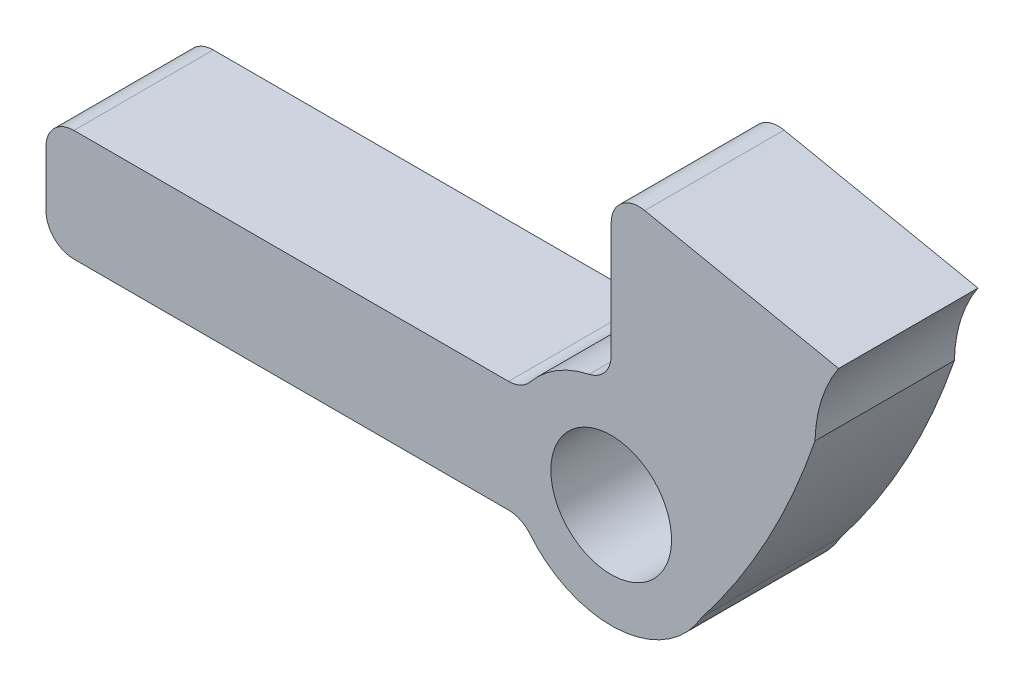
ISO-10303-21;
HEADER;
FILE_DESCRIPTION(('STEP AP214'),'2;1');
FILE_NAME('part.step','',(''),(''),'','','');
FILE_SCHEMA(('AUTOMOTIVE_DESIGN { 1 0 10303 214 1 1 1 1 }'));
ENDSEC;
DATA;
#1=APPLICATION_CONTEXT('core data for automotive mechanical design processes');
#2=APPLICATION_PROTOCOL_DEFINITION('international standard','automotive_design',2000,#1);
#3=PRODUCT_CONTEXT('',#1,'mechanical');
#4=PRODUCT('Part','Part','',(#3));
#5=PRODUCT_RELATED_PRODUCT_CATEGORY('part','',(#4));
#6=PRODUCT_DEFINITION_FORMATION('','',#4);
#7=PRODUCT_DEFINITION_CONTEXT('part definition',#1,'design');
#8=PRODUCT_DEFINITION('design','',#6,#7);
#9=PRODUCT_DEFINITION_SHAPE('','',#8);
#10=(LENGTH_UNIT() NAMED_UNIT(*) SI_UNIT(.MILLI.,.METRE.));
#11=(NAMED_UNIT(*) PLANE_ANGLE_UNIT() SI_UNIT($,.RADIAN.));
#12=(NAMED_UNIT(*) SI_UNIT($,.STERADIAN.) SOLID_ANGLE_UNIT());
#13=UNCERTAINTY_MEASURE_WITH_UNIT(LENGTH_MEASURE(1.E-05),#10,'distance_accuracy_value','');
#14=(GEOMETRIC_REPRESENTATION_CONTEXT(3) GLOBAL_UNCERTAINTY_ASSIGNED_CONTEXT((#13)) GLOBAL_UNIT_ASSIGNED_CONTEXT((#10,
#11,#12)) REPRESENTATION_CONTEXT('',''));
#15=CARTESIAN_POINT('',(0.,0.,0.));
#16=DIRECTION('',(0.,0.,1.));
#17=DIRECTION('',(1.,0.,0.));
#18=AXIS2_PLACEMENT_3D('',#15,#16,#17);
#19=CARTESIAN_POINT('',(0.,0.,0.));
#20=DIRECTION('',(0.,0.,-1.));
#21=DIRECTION('',(-1.,0.,0.));
#22=AXIS2_PLACEMENT_3D('',#19,#20,#21);
#23=PLANE('',#22);
#24=CARTESIAN_POINT('',(31.5279016396523,26.917706060105,0.));
#25=DIRECTION('',(0.,0.,-1.));
#26=DIRECTION('',(-1.,0.,0.));
#27=AXIS2_PLACEMENT_3D('',#24,#25,#26);
#28=CIRCLE('',#27,2.75);
#29=CARTESIAN_POINT('',(28.7779016396523,26.917706060105,0.));
#30=VERTEX_POINT('',#29);
#31=EDGE_CURVE('E43',#30,#30,#28,.T.);
#32=ORIENTED_EDGE('',*,*,#31,.F.);
#33=EDGE_LOOP('',(#32));
#34=FACE_BOUND('',#33,.T.);
#35=CARTESIAN_POINT('',(47.1645659339847,33.9451594546823,0.));
#36=DIRECTION('',(0.,0.,1.));
#37=DIRECTION('',(-1.,0.,0.));
#38=AXIS2_PLACEMENT_3D('',#35,#36,#37);
#39=CIRCLE('',#38,6.35000000000001);
#40=CARTESIAN_POINT('',(41.893380204959,37.4859363482631,0.));
#41=VERTEX_POINT('',#40);
#42=CARTESIAN_POINT('',(40.8161922352779,34.0888653403209,0.));
#43=VERTEX_POINT('',#42);
#44=EDGE_CURVE('E170',#41,#43,#39,.T.);
#45=ORIENTED_EDGE('',*,*,#44,.T.);
#46=CARTESIAN_POINT('',(9.96866323767214,44.5924918390402,0.));
#47=DIRECTION('',(0.,0.,-1.));
#48=DIRECTION('',(-1.,0.,0.));
#49=AXIS2_PLACEMENT_3D('',#46,#47,#48);
#50=CIRCLE('',#49,32.5867490689502);
#51=CARTESIAN_POINT('',(35.6523476251745,24.5364560601058,0.));
#52=VERTEX_POINT('',#51);
#53=EDGE_CURVE('E216',#43,#52,#50,.T.);
#54=ORIENTED_EDGE('',*,*,#53,.T.);
#55=CARTESIAN_POINT('',(31.5279016396523,26.917706060105,0.));
#56=DIRECTION('',(0.,0.,-1.));
#57=DIRECTION('',(-1.,0.,0.));
#58=AXIS2_PLACEMENT_3D('',#55,#56,#57);
#59=CIRCLE('',#58,4.76249999999865);
#60=CARTESIAN_POINT('',(27.8354802793434,23.909811323263,0.));
#61=VERTEX_POINT('',#60);
#62=EDGE_CURVE('E214',#52,#61,#59,.T.);
#63=ORIENTED_EDGE('',*,*,#62,.T.);
#64=CARTESIAN_POINT('',(26.8508345832607,23.1077060601049,0.));
#65=DIRECTION('',(0.,0.,1.));
#66=DIRECTION('',(-1.,0.,0.));
#67=AXIS2_PLACEMENT_3D('',#64,#65,#66);
#68=CIRCLE('',#67,1.27);
#69=CARTESIAN_POINT('',(26.8508345832607,24.3777060601049,0.));
#70=VERTEX_POINT('',#69);
#71=EDGE_CURVE('E62',#61,#70,#68,.T.);
#72=ORIENTED_EDGE('',*,*,#71,.T.);
#73=DIRECTION('',(-1.,0.,0.));
#74=VECTOR('',#73,1.);
#75=CARTESIAN_POINT('',(26.8508345832607,24.3777060601049,0.));
#76=LINE('',#75,#74);
#77=CARTESIAN_POINT('',(7.04230163965219,24.3777060601049,0.));
#78=VERTEX_POINT('',#77);
#79=EDGE_CURVE('E210',#70,#78,#76,.T.);
#80=ORIENTED_EDGE('',*,*,#79,.T.);
#81=CARTESIAN_POINT('',(7.04230163965224,25.6477060601049,0.));
#82=DIRECTION('',(0.,0.,-1.));
#83=DIRECTION('',(-1.,0.,0.));
#84=AXIS2_PLACEMENT_3D('',#81,#82,#83);
#85=CIRCLE('',#84,1.27000000000003);
#86=CARTESIAN_POINT('',(5.77230163965221,25.6477060601049,0.));
#87=VERTEX_POINT('',#86);
#88=EDGE_CURVE('E207',#78,#87,#85,.T.);
#89=ORIENTED_EDGE('',*,*,#88,.T.);
#90=DIRECTION('',(0.,1.,0.));
#91=VECTOR('',#90,1.);
#92=CARTESIAN_POINT('',(5.77230163965224,28.1877060601049,0.));
#93=LINE('',#92,#91);
#94=CARTESIAN_POINT('',(5.77230163965224,28.1877060601049,0.));
#95=VERTEX_POINT('',#94);
#96=EDGE_CURVE('E204',#87,#95,#93,.T.);
#97=ORIENTED_EDGE('',*,*,#96,.T.);
#98=CARTESIAN_POINT('',(7.04230163965223,28.1877060601049,0.));
#99=DIRECTION('',(0.,0.,-1.));
#100=DIRECTION('',(-1.,0.,0.));
#101=AXIS2_PLACEMENT_3D('',#98,#99,#100);
#102=CIRCLE('',#101,1.27);
#103=CARTESIAN_POINT('',(7.04230163965223,29.4577060601049,0.));
#104=VERTEX_POINT('',#103);
#105=EDGE_CURVE('E201',#95,#104,#102,.T.);
#106=ORIENTED_EDGE('',*,*,#105,.T.);
#107=DIRECTION('',(1.,0.,0.));
#108=VECTOR('',#107,1.);
#109=CARTESIAN_POINT('',(26.8508345832607,29.4577060601049,0.));
#110=LINE('',#109,#108);
#111=CARTESIAN_POINT('',(26.8508345832607,29.4577060601049,0.));
#112=VERTEX_POINT('',#111);
#113=EDGE_CURVE('E198',#104,#112,#110,.T.);
#114=ORIENTED_EDGE('',*,*,#113,.T.);
#115=CARTESIAN_POINT('',(26.8508345832607,30.7277060601049,0.));
#116=DIRECTION('',(0.,0.,1.));
#117=DIRECTION('',(-1.,0.,0.));
#118=AXIS2_PLACEMENT_3D('',#115,#116,#117);
#119=CIRCLE('',#118,1.27);
#120=CARTESIAN_POINT('',(27.8354802793434,29.9256007969468,0.));
#121=VERTEX_POINT('',#120);
#122=EDGE_CURVE('E195',#112,#121,#119,.T.);
#123=ORIENTED_EDGE('',*,*,#122,.T.);
#124=CARTESIAN_POINT('',(31.5279016396523,26.917706060105,0.));
#125=DIRECTION('',(0.,0.,-1.));
#126=DIRECTION('',(-1.,0.,0.));
#127=AXIS2_PLACEMENT_3D('',#124,#125,#126);
#128=CIRCLE('',#127,4.76249999999849);
#129=CARTESIAN_POINT('',(30.5252700607049,31.5734698177374,0.));
#130=VERTEX_POINT('',#129);
#131=EDGE_CURVE('E192',#121,#130,#128,.T.);
#132=ORIENTED_EDGE('',*,*,#131,.T.);
#133=CARTESIAN_POINT('',(30.2579016396522,32.8150068197731,0.));
#134=DIRECTION('',(0.,0.,1.));
#135=DIRECTION('',(-1.,0.,0.));
#136=AXIS2_PLACEMENT_3D('',#133,#134,#135);
#137=CIRCLE('',#136,1.27000000000001);
#138=CARTESIAN_POINT('',(31.5279016396522,32.8150068197731,0.));
#139=VERTEX_POINT('',#138);
#140=EDGE_CURVE('E189',#130,#139,#137,.T.);
#141=ORIENTED_EDGE('',*,*,#140,.T.);
#142=DIRECTION('',(0.,1.,0.));
#143=VECTOR('',#142,1.);
#144=CARTESIAN_POINT('',(31.5279016396522,38.0574046258228,0.));
#145=LINE('',#144,#143);
#146=CARTESIAN_POINT('',(31.5279016396522,38.0574046258228,0.));
#147=VERTEX_POINT('',#146);
#148=EDGE_CURVE('E186',#139,#147,#145,.T.);
#149=ORIENTED_EDGE('',*,*,#148,.T.);
#150=CARTESIAN_POINT('',(32.7979016396522,38.0574046258228,0.));
#151=DIRECTION('',(0.,0.,-1.));
#152=DIRECTION('',(-1.,0.,0.));
#153=AXIS2_PLACEMENT_3D('',#150,#151,#152);
#154=CIRCLE('',#153,1.27);
#155=CARTESIAN_POINT('',(33.0557148185302,39.3009609634275,0.));
#156=VERTEX_POINT('',#155);
#157=EDGE_CURVE('E178',#147,#156,#154,.T.);
#158=ORIENTED_EDGE('',*,*,#157,.T.);
#159=DIRECTION('',(0.979555324329309,-0.201174965087861,0.));
#160=VECTOR('',#159,1.);
#161=CARTESIAN_POINT('',(41.893380204959,37.4859363482631,0.));
#162=LINE('',#161,#160);
#163=EDGE_CURVE('E172',#156,#41,#162,.T.);
#164=ORIENTED_EDGE('',*,*,#163,.T.);
#165=EDGE_LOOP('',(#45,#54,#63,#72,#80,#89,#97,#106,#114,#123,#132,#141,#149,#158,#164));
#166=FACE_BOUND('',#165,.T.);
#167=ADVANCED_FACE('F40',(#34,#166),#23,.T.);
#168=CARTESIAN_POINT('',(31.5279016396523,26.917706060105,6.35));
#169=DIRECTION('',(0.,0.,-1.));
#170=DIRECTION('',(-1.,0.,0.));
#171=AXIS2_PLACEMENT_3D('',#168,#169,#170);
#172=CYLINDRICAL_SURFACE('',#171,2.75);
#173=CARTESIAN_POINT('',(31.5279016396523,26.917706060105,6.35));
#174=DIRECTION('',(0.,0.,-1.));
#175=DIRECTION('',(-1.,0.,0.));
#176=AXIS2_PLACEMENT_3D('',#173,#174,#175);
#177=CIRCLE('',#176,2.75);
#178=CARTESIAN_POINT('',(28.7779016396523,26.917706060105,6.35));
#179=VERTEX_POINT('',#178);
#180=EDGE_CURVE('E12',#179,#179,#177,.T.);
#181=ORIENTED_EDGE('',*,*,#180,.F.);
#182=EDGE_LOOP('',(#181));
#183=FACE_BOUND('',#182,.T.);
#184=ORIENTED_EDGE('',*,*,#31,.T.);
#185=EDGE_LOOP('',(#184));
#186=FACE_BOUND('',#185,.T.);
#187=ADVANCED_FACE('F300',(#183,#186),#172,.F.);
#188=CARTESIAN_POINT('',(9.96866323767214,44.5924918390402,6.35));
#189=DIRECTION('',(0.,0.,-1.));
#190=DIRECTION('',(-1.,0.,0.));
#191=AXIS2_PLACEMENT_3D('',#188,#189,#190);
#192=CYLINDRICAL_SURFACE('',#191,32.5867490689502);
#193=ORIENTED_EDGE('',*,*,#53,.F.);
#194=DIRECTION('',(0.,0.,-1.));
#195=VECTOR('',#194,1.);
#196=CARTESIAN_POINT('',(40.8161922352779,34.0888653403209,6.35));
#197=LINE('',#196,#195);
#198=CARTESIAN_POINT('',(40.8161922352779,34.0888653403209,6.35));
#199=VERTEX_POINT('',#198);
#200=EDGE_CURVE('E181',#199,#43,#197,.T.);
#201=ORIENTED_EDGE('',*,*,#200,.F.);
#202=CARTESIAN_POINT('',(9.96866323767214,44.5924918390402,6.35));
#203=DIRECTION('',(0.,0.,-1.));
#204=DIRECTION('',(-1.,0.,0.));
#205=AXIS2_PLACEMENT_3D('',#202,#203,#204);
#206=CIRCLE('',#205,32.5867490689502);
#207=CARTESIAN_POINT('',(35.6523476251745,24.5364560601058,6.35));
#208=VERTEX_POINT('',#207);
#209=EDGE_CURVE('E54',#199,#208,#206,.T.);
#210=ORIENTED_EDGE('',*,*,#209,.T.);
#211=DIRECTION('',(0.,0.,-1.));
#212=VECTOR('',#211,1.);
#213=CARTESIAN_POINT('',(35.6523476251745,24.5364560601058,6.35));
#214=LINE('',#213,#212);
#215=EDGE_CURVE('E153',#208,#52,#214,.T.);
#216=ORIENTED_EDGE('',*,*,#215,.T.);
#217=EDGE_LOOP('',(#193,#201,#210,#216));
#218=FACE_BOUND('',#217,.T.);
#219=ADVANCED_FACE('F286',(#218),#192,.T.);
#220=CARTESIAN_POINT('',(47.1645659339847,33.9451594546823,6.35));
#221=DIRECTION('',(0.,0.,-1.));
#222=DIRECTION('',(-1.,0.,0.));
#223=AXIS2_PLACEMENT_3D('',#220,#221,#222);
#224=CYLINDRICAL_SURFACE('',#223,6.35000000000001);
#225=ORIENTED_EDGE('',*,*,#44,.F.);
#226=DIRECTION('',(0.,0.,-1.));
#227=VECTOR('',#226,1.);
#228=CARTESIAN_POINT('',(41.893380204959,37.4859363482631,6.35));
#229=LINE('',#228,#227);
#230=CARTESIAN_POINT('',(41.893380204959,37.4859363482631,6.35));
#231=VERTEX_POINT('',#230);
#232=EDGE_CURVE('E279',#231,#41,#229,.T.);
#233=ORIENTED_EDGE('',*,*,#232,.F.);
#234=CARTESIAN_POINT('',(47.1645659339847,33.9451594546823,6.35));
#235=DIRECTION('',(0.,0.,1.));
#236=DIRECTION('',(-1.,0.,0.));
#237=AXIS2_PLACEMENT_3D('',#234,#235,#236);
#238=CIRCLE('',#237,6.35000000000001);
#239=EDGE_CURVE('E218',#231,#199,#238,.T.);
#240=ORIENTED_EDGE('',*,*,#239,.T.);
#241=ORIENTED_EDGE('',*,*,#200,.T.);
#242=EDGE_LOOP('',(#225,#233,#240,#241));
#243=FACE_BOUND('',#242,.T.);
#244=ADVANCED_FACE('F284',(#243),#224,.F.);
#245=CARTESIAN_POINT('',(41.893380204959,37.4859363482631,6.35));
#246=DIRECTION('',(0.201174965087861,0.979555324329309,0.));
#247=DIRECTION('',(-0.979555324329309,0.201174965087861,0.));
#248=AXIS2_PLACEMENT_3D('',#245,#246,#247);
#249=PLANE('',#248);
#250=ORIENTED_EDGE('',*,*,#163,.F.);
#251=DIRECTION('',(0.,0.,-1.));
#252=VECTOR('',#251,1.);
#253=CARTESIAN_POINT('',(33.0557148185302,39.3009609634275,6.35));
#254=LINE('',#253,#252);
#255=CARTESIAN_POINT('',(33.0557148185302,39.3009609634275,6.35));
#256=VERTEX_POINT('',#255);
#257=EDGE_CURVE('E278',#256,#156,#254,.T.);
#258=ORIENTED_EDGE('',*,*,#257,.F.);
#259=DIRECTION('',(0.979555324329309,-0.201174965087861,0.));
#260=VECTOR('',#259,1.);
#261=CARTESIAN_POINT('',(41.893380204959,37.4859363482631,6.35));
#262=LINE('',#261,#260);
#263=EDGE_CURVE('E221',#256,#231,#262,.T.);
#264=ORIENTED_EDGE('',*,*,#263,.T.);
#265=ORIENTED_EDGE('',*,*,#232,.T.);
#266=EDGE_LOOP('',(#250,#258,#264,#265));
#267=FACE_BOUND('',#266,.T.);
#268=ADVANCED_FACE('F419',(#267),#249,.T.);
#269=CARTESIAN_POINT('',(32.7979016396522,38.0574046258228,6.35));
#270=DIRECTION('',(0.,0.,-1.));
#271=DIRECTION('',(-1.,0.,0.));
#272=AXIS2_PLACEMENT_3D('',#269,#270,#271);
#273=CYLINDRICAL_SURFACE('',#272,1.27);
#274=ORIENTED_EDGE('',*,*,#157,.F.);
#275=DIRECTION('',(0.,0.,-1.));
#276=VECTOR('',#275,1.);
#277=CARTESIAN_POINT('',(31.5279016396522,38.0574046258228,6.35));
#278=LINE('',#277,#276);
#279=CARTESIAN_POINT('',(31.5279016396522,38.0574046258228,6.35));
#280=VERTEX_POINT('',#279);
#281=EDGE_CURVE('E276',#280,#147,#278,.T.);
#282=ORIENTED_EDGE('',*,*,#281,.F.);
#283=CARTESIAN_POINT('',(32.7979016396522,38.0574046258228,6.35));
#284=DIRECTION('',(0.,0.,-1.));
#285=DIRECTION('',(-1.,0.,0.));
#286=AXIS2_PLACEMENT_3D('',#283,#284,#285);
#287=CIRCLE('',#286,1.27);
#288=EDGE_CURVE('E224',#280,#256,#287,.T.);
#289=ORIENTED_EDGE('',*,*,#288,.T.);
#290=ORIENTED_EDGE('',*,*,#257,.T.);
#291=EDGE_LOOP('',(#274,#282,#289,#290));
#292=FACE_BOUND('',#291,.T.);
#293=ADVANCED_FACE('F409',(#292),#273,.T.);
#294=CARTESIAN_POINT('',(31.5279016396522,38.0574046258228,6.35));
#295=DIRECTION('',(-1.,0.,0.));
#296=DIRECTION('',(0.,-1.,0.));
#297=AXIS2_PLACEMENT_3D('',#294,#295,#296);
#298=PLANE('',#297);
#299=ORIENTED_EDGE('',*,*,#148,.F.);
#300=DIRECTION('',(0.,0.,-1.));
#301=VECTOR('',#300,1.);
#302=CARTESIAN_POINT('',(31.5279016396522,32.8150068197731,6.35));
#303=LINE('',#302,#301);
#304=CARTESIAN_POINT('',(31.5279016396522,32.8150068197731,6.35));
#305=VERTEX_POINT('',#304);
#306=EDGE_CURVE('E274',#305,#139,#303,.T.);
#307=ORIENTED_EDGE('',*,*,#306,.F.);
#308=DIRECTION('',(0.,1.,0.));
#309=VECTOR('',#308,1.);
#310=CARTESIAN_POINT('',(31.5279016396522,38.0574046258228,6.35));
#311=LINE('',#310,#309);
#312=EDGE_CURVE('E227',#305,#280,#311,.T.);
#313=ORIENTED_EDGE('',*,*,#312,.T.);
#314=ORIENTED_EDGE('',*,*,#281,.T.);
#315=EDGE_LOOP('',(#299,#307,#313,#314));
#316=FACE_BOUND('',#315,.T.);
#317=ADVANCED_FACE('F399',(#316),#298,.T.);
#318=CARTESIAN_POINT('',(30.2579016396522,32.8150068197731,6.35));
#319=DIRECTION('',(0.,0.,-1.));
#320=DIRECTION('',(-1.,0.,0.));
#321=AXIS2_PLACEMENT_3D('',#318,#319,#320);
#322=CYLINDRICAL_SURFACE('',#321,1.27000000000001);
#323=ORIENTED_EDGE('',*,*,#140,.F.);
#324=DIRECTION('',(0.,0.,-1.));
#325=VECTOR('',#324,1.);
#326=CARTESIAN_POINT('',(30.5252700607049,31.5734698177374,6.35));
#327=LINE('',#326,#325);
#328=CARTESIAN_POINT('',(30.5252700607049,31.5734698177374,6.35));
#329=VERTEX_POINT('',#328);
#330=EDGE_CURVE('E272',#329,#130,#327,.T.);
#331=ORIENTED_EDGE('',*,*,#330,.F.);
#332=CARTESIAN_POINT('',(30.2579016396522,32.8150068197731,6.35));
#333=DIRECTION('',(0.,0.,1.));
#334=DIRECTION('',(-1.,0.,0.));
#335=AXIS2_PLACEMENT_3D('',#332,#333,#334);
#336=CIRCLE('',#335,1.27000000000001);
#337=EDGE_CURVE('E230',#329,#305,#336,.T.);
#338=ORIENTED_EDGE('',*,*,#337,.T.);
#339=ORIENTED_EDGE('',*,*,#306,.T.);
#340=EDGE_LOOP('',(#323,#331,#338,#339));
#341=FACE_BOUND('',#340,.T.);
#342=ADVANCED_FACE('F389',(#341),#322,.F.);
#343=CARTESIAN_POINT('',(31.5279016396523,26.917706060105,6.35));
#344=DIRECTION('',(0.,0.,-1.));
#345=DIRECTION('',(-1.,0.,0.));
#346=AXIS2_PLACEMENT_3D('',#343,#344,#345);
#347=CYLINDRICAL_SURFACE('',#346,4.76249999999849);
#348=ORIENTED_EDGE('',*,*,#131,.F.);
#349=DIRECTION('',(0.,0.,-1.));
#350=VECTOR('',#349,1.);
#351=CARTESIAN_POINT('',(27.8354802793434,29.9256007969468,6.35));
#352=LINE('',#351,#350);
#353=CARTESIAN_POINT('',(27.8354802793434,29.9256007969468,6.35));
#354=VERTEX_POINT('',#353);
#355=EDGE_CURVE('E270',#354,#121,#352,.T.);
#356=ORIENTED_EDGE('',*,*,#355,.F.);
#357=CARTESIAN_POINT('',(31.5279016396523,26.917706060105,6.35));
#358=DIRECTION('',(0.,0.,-1.));
#359=DIRECTION('',(-1.,0.,0.));
#360=AXIS2_PLACEMENT_3D('',#357,#358,#359);
#361=CIRCLE('',#360,4.76249999999849);
#362=EDGE_CURVE('E233',#354,#329,#361,.T.);
#363=ORIENTED_EDGE('',*,*,#362,.T.);
#364=ORIENTED_EDGE('',*,*,#330,.T.);
#365=EDGE_LOOP('',(#348,#356,#363,#364));
#366=FACE_BOUND('',#365,.T.);
#367=ADVANCED_FACE('F379',(#366),#347,.T.);
#368=CARTESIAN_POINT('',(26.8508345832607,30.7277060601049,6.35));
#369=DIRECTION('',(0.,0.,-1.));
#370=DIRECTION('',(-1.,0.,0.));
#371=AXIS2_PLACEMENT_3D('',#368,#369,#370);
#372=CYLINDRICAL_SURFACE('',#371,1.27);
#373=ORIENTED_EDGE('',*,*,#122,.F.);
#374=DIRECTION('',(0.,0.,-1.));
#375=VECTOR('',#374,1.);
#376=CARTESIAN_POINT('',(26.8508345832607,29.4577060601049,6.35));
#377=LINE('',#376,#375);
#378=CARTESIAN_POINT('',(26.8508345832607,29.4577060601049,6.35));
#379=VERTEX_POINT('',#378);
#380=EDGE_CURVE('E268',#379,#112,#377,.T.);
#381=ORIENTED_EDGE('',*,*,#380,.F.);
#382=CARTESIAN_POINT('',(26.8508345832607,30.7277060601049,6.35));
#383=DIRECTION('',(0.,0.,1.));
#384=DIRECTION('',(-1.,0.,0.));
#385=AXIS2_PLACEMENT_3D('',#382,#383,#384);
#386=CIRCLE('',#385,1.27);
#387=EDGE_CURVE('E236',#379,#354,#386,.T.);
#388=ORIENTED_EDGE('',*,*,#387,.T.);
#389=ORIENTED_EDGE('',*,*,#355,.T.);
#390=EDGE_LOOP('',(#373,#381,#388,#389));
#391=FACE_BOUND('',#390,.T.);
#392=ADVANCED_FACE('F369',(#391),#372,.F.);
#393=CARTESIAN_POINT('',(26.8508345832607,29.4577060601049,6.35));
#394=DIRECTION('',(0.,1.,0.));
#395=DIRECTION('',(-1.,0.,0.));
#396=AXIS2_PLACEMENT_3D('',#393,#394,#395);
#397=PLANE('',#396);
#398=ORIENTED_EDGE('',*,*,#113,.F.);
#399=DIRECTION('',(0.,0.,-1.));
#400=VECTOR('',#399,1.);
#401=CARTESIAN_POINT('',(7.04230163965223,29.4577060601049,6.35));
#402=LINE('',#401,#400);
#403=CARTESIAN_POINT('',(7.04230163965223,29.4577060601049,6.35));
#404=VERTEX_POINT('',#403);
#405=EDGE_CURVE('E263',#404,#104,#402,.T.);
#406=ORIENTED_EDGE('',*,*,#405,.F.);
#407=DIRECTION('',(1.,0.,0.));
#408=VECTOR('',#407,1.);
#409=CARTESIAN_POINT('',(26.8508345832607,29.4577060601049,6.35));
#410=LINE('',#409,#408);
#411=EDGE_CURVE('E239',#404,#379,#410,.T.);
#412=ORIENTED_EDGE('',*,*,#411,.T.);
#413=ORIENTED_EDGE('',*,*,#380,.T.);
#414=EDGE_LOOP('',(#398,#406,#412,#413));
#415=FACE_BOUND('',#414,.T.);
#416=ADVANCED_FACE('F359',(#415),#397,.T.);
#417=CARTESIAN_POINT('',(7.04230163965223,28.1877060601049,6.35));
#418=DIRECTION('',(0.,0.,-1.));
#419=DIRECTION('',(-1.,0.,0.));
#420=AXIS2_PLACEMENT_3D('',#417,#418,#419);
#421=CYLINDRICAL_SURFACE('',#420,1.27);
#422=ORIENTED_EDGE('',*,*,#105,.F.);
#423=DIRECTION('',(0.,0.,-1.));
#424=VECTOR('',#423,1.);
#425=CARTESIAN_POINT('',(5.77230163965224,28.1877060601049,6.35));
#426=LINE('',#425,#424);
#427=CARTESIAN_POINT('',(5.77230163965224,28.1877060601049,6.35));
#428=VERTEX_POINT('',#427);
#429=EDGE_CURVE('E259',#428,#95,#426,.T.);
#430=ORIENTED_EDGE('',*,*,#429,.F.);
#431=CARTESIAN_POINT('',(7.04230163965223,28.1877060601049,6.35));
#432=DIRECTION('',(0.,0.,-1.));
#433=DIRECTION('',(-1.,0.,0.));
#434=AXIS2_PLACEMENT_3D('',#431,#432,#433);
#435=CIRCLE('',#434,1.27);
#436=EDGE_CURVE('E242',#428,#404,#435,.T.);
#437=ORIENTED_EDGE('',*,*,#436,.T.);
#438=ORIENTED_EDGE('',*,*,#405,.T.);
#439=EDGE_LOOP('',(#422,#430,#437,#438));
#440=FACE_BOUND('',#439,.T.);
#441=ADVANCED_FACE('F350',(#440),#421,.T.);
#442=CARTESIAN_POINT('',(5.77230163965224,28.1877060601049,6.35));
#443=DIRECTION('',(-1.,0.,0.));
#444=DIRECTION('',(0.,-1.,0.));
#445=AXIS2_PLACEMENT_3D('',#442,#443,#444);
#446=PLANE('',#445);
#447=ORIENTED_EDGE('',*,*,#96,.F.);
#448=DIRECTION('',(0.,0.,-1.));
#449=VECTOR('',#448,1.);
#450=CARTESIAN_POINT('',(5.77230163965221,25.6477060601049,6.35));
#451=LINE('',#450,#449);
#452=CARTESIAN_POINT('',(5.77230163965221,25.6477060601049,6.35));
#453=VERTEX_POINT('',#452);
#454=EDGE_CURVE('E252',#453,#87,#451,.T.);
#455=ORIENTED_EDGE('',*,*,#454,.F.);
#456=DIRECTION('',(0.,1.,0.));
#457=VECTOR('',#456,1.);
#458=CARTESIAN_POINT('',(5.77230163965224,28.1877060601049,6.35));
#459=LINE('',#458,#457);
#460=EDGE_CURVE('E245',#453,#428,#459,.T.);
#461=ORIENTED_EDGE('',*,*,#460,.T.);
#462=ORIENTED_EDGE('',*,*,#429,.T.);
#463=EDGE_LOOP('',(#447,#455,#461,#462));
#464=FACE_BOUND('',#463,.T.);
#465=ADVANCED_FACE('F258',(#464),#446,.T.);
#466=CARTESIAN_POINT('',(7.04230163965224,25.6477060601049,6.35));
#467=DIRECTION('',(0.,0.,-1.));
#468=DIRECTION('',(-1.,0.,0.));
#469=AXIS2_PLACEMENT_3D('',#466,#467,#468);
#470=CYLINDRICAL_SURFACE('',#469,1.27000000000003);
#471=ORIENTED_EDGE('',*,*,#88,.F.);
#472=DIRECTION('',(0.,0.,-1.));
#473=VECTOR('',#472,1.);
#474=CARTESIAN_POINT('',(7.04230163965219,24.3777060601049,6.35));
#475=LINE('',#474,#473);
#476=CARTESIAN_POINT('',(7.04230163965219,24.3777060601049,6.35));
#477=VERTEX_POINT('',#476);
#478=EDGE_CURVE('E254',#477,#78,#475,.T.);
#479=ORIENTED_EDGE('',*,*,#478,.F.);
#480=CARTESIAN_POINT('',(7.04230163965224,25.6477060601049,6.35));
#481=DIRECTION('',(0.,0.,-1.));
#482=DIRECTION('',(-1.,0.,0.));
#483=AXIS2_PLACEMENT_3D('',#480,#481,#482);
#484=CIRCLE('',#483,1.27000000000003);
#485=EDGE_CURVE('E166',#477,#453,#484,.T.);
#486=ORIENTED_EDGE('',*,*,#485,.T.);
#487=ORIENTED_EDGE('',*,*,#454,.T.);
#488=EDGE_LOOP('',(#471,#479,#486,#487));
#489=FACE_BOUND('',#488,.T.);
#490=ADVANCED_FACE('F251',(#489),#470,.T.);
#491=CARTESIAN_POINT('',(26.8508345832607,24.3777060601049,6.35));
#492=DIRECTION('',(0.,-1.,0.));
#493=DIRECTION('',(1.,0.,0.));
#494=AXIS2_PLACEMENT_3D('',#491,#492,#493);
#495=PLANE('',#494);
#496=ORIENTED_EDGE('',*,*,#79,.F.);
#497=DIRECTION('',(0.,0.,-1.));
#498=VECTOR('',#497,1.);
#499=CARTESIAN_POINT('',(26.8508345832607,24.3777060601049,6.35));
#500=LINE('',#499,#498);
#501=CARTESIAN_POINT('',(26.8508345832607,24.3777060601049,6.35));
#502=VERTEX_POINT('',#501);
#503=EDGE_CURVE('E154',#502,#70,#500,.T.);
#504=ORIENTED_EDGE('',*,*,#503,.F.);
#505=DIRECTION('',(-1.,0.,0.));
#506=VECTOR('',#505,1.);
#507=CARTESIAN_POINT('',(26.8508345832607,24.3777060601049,6.35));
#508=LINE('',#507,#506);
#509=EDGE_CURVE('E164',#502,#477,#508,.T.);
#510=ORIENTED_EDGE('',*,*,#509,.T.);
#511=ORIENTED_EDGE('',*,*,#478,.T.);
#512=EDGE_LOOP('',(#496,#504,#510,#511));
#513=FACE_BOUND('',#512,.T.);
#514=ADVANCED_FACE('F289',(#513),#495,.T.);
#515=CARTESIAN_POINT('',(26.8508345832607,23.1077060601049,6.35));
#516=DIRECTION('',(0.,0.,-1.));
#517=DIRECTION('',(-1.,0.,0.));
#518=AXIS2_PLACEMENT_3D('',#515,#516,#517);
#519=CYLINDRICAL_SURFACE('',#518,1.27);
#520=ORIENTED_EDGE('',*,*,#71,.F.);
#521=DIRECTION('',(0.,0.,-1.));
#522=VECTOR('',#521,1.);
#523=CARTESIAN_POINT('',(27.8354802793434,23.909811323263,6.35));
#524=LINE('',#523,#522);
#525=CARTESIAN_POINT('',(27.8354802793434,23.909811323263,6.35));
#526=VERTEX_POINT('',#525);
#527=EDGE_CURVE('E144',#526,#61,#524,.T.);
#528=ORIENTED_EDGE('',*,*,#527,.F.);
#529=CARTESIAN_POINT('',(26.8508345832607,23.1077060601049,6.35));
#530=DIRECTION('',(0.,0.,1.));
#531=DIRECTION('',(-1.,0.,0.));
#532=AXIS2_PLACEMENT_3D('',#529,#530,#531);
#533=CIRCLE('',#532,1.27);
#534=EDGE_CURVE('E148',#526,#502,#533,.T.);
#535=ORIENTED_EDGE('',*,*,#534,.T.);
#536=ORIENTED_EDGE('',*,*,#503,.T.);
#537=EDGE_LOOP('',(#520,#528,#535,#536));
#538=FACE_BOUND('',#537,.T.);
#539=ADVANCED_FACE('F146',(#538),#519,.F.);
#540=CARTESIAN_POINT('',(31.5279016396523,26.917706060105,6.35));
#541=DIRECTION('',(0.,0.,-1.));
#542=DIRECTION('',(-1.,0.,0.));
#543=AXIS2_PLACEMENT_3D('',#540,#541,#542);
#544=CYLINDRICAL_SURFACE('',#543,4.76249999999865);
#545=ORIENTED_EDGE('',*,*,#62,.F.);
#546=ORIENTED_EDGE('',*,*,#215,.F.);
#547=CARTESIAN_POINT('',(31.5279016396523,26.917706060105,6.35));
#548=DIRECTION('',(0.,0.,-1.));
#549=DIRECTION('',(-1.,0.,0.));
#550=AXIS2_PLACEMENT_3D('',#547,#548,#549);
#551=CIRCLE('',#550,4.76249999999865);
#552=EDGE_CURVE('E157',#208,#526,#551,.T.);
#553=ORIENTED_EDGE('',*,*,#552,.T.);
#554=ORIENTED_EDGE('',*,*,#527,.T.);
#555=EDGE_LOOP('',(#545,#546,#553,#554));
#556=FACE_BOUND('',#555,.T.);
#557=ADVANCED_FACE('F158',(#556),#544,.T.);
#558=CARTESIAN_POINT('',(0.,0.,6.35));
#559=DIRECTION('',(0.,0.,-1.));
#560=DIRECTION('',(-1.,0.,0.));
#561=AXIS2_PLACEMENT_3D('',#558,#559,#560);
#562=PLANE('',#561);
#563=ORIENTED_EDGE('',*,*,#180,.T.);
#564=EDGE_LOOP('',(#563));
#565=FACE_BOUND('',#564,.T.);
#566=ORIENTED_EDGE('',*,*,#209,.F.);
#567=ORIENTED_EDGE('',*,*,#239,.F.);
#568=ORIENTED_EDGE('',*,*,#263,.F.);
#569=ORIENTED_EDGE('',*,*,#288,.F.);
#570=ORIENTED_EDGE('',*,*,#312,.F.);
#571=ORIENTED_EDGE('',*,*,#337,.F.);
#572=ORIENTED_EDGE('',*,*,#362,.F.);
#573=ORIENTED_EDGE('',*,*,#387,.F.);
#574=ORIENTED_EDGE('',*,*,#411,.F.);
#575=ORIENTED_EDGE('',*,*,#436,.F.);
#576=ORIENTED_EDGE('',*,*,#460,.F.);
#577=ORIENTED_EDGE('',*,*,#485,.F.);
#578=ORIENTED_EDGE('',*,*,#509,.F.);
#579=ORIENTED_EDGE('',*,*,#534,.F.);
#580=ORIENTED_EDGE('',*,*,#552,.F.);
#581=EDGE_LOOP('',(#566,#567,#568,#569,#570,#571,#572,#573,#574,#575,#576,#577,#578,#579,#580));
#582=FACE_BOUND('',#581,.T.);
#583=ADVANCED_FACE('F161',(#565,#582),#562,.F.);
#584=CLOSED_SHELL('',(#167,#187,#219,#244,#268,#293,#317,#342,#367,#392,#416,#441,#465,#490,
#514,#539,#557,#583));
#585=MANIFOLD_SOLID_BREP('B2',#584);
#586=ADVANCED_BREP_SHAPE_REPRESENTATION('',(#18,#585),#14);
#587=SHAPE_DEFINITION_REPRESENTATION(#9,#586);
ENDSEC;
END-ISO-10303-21;
